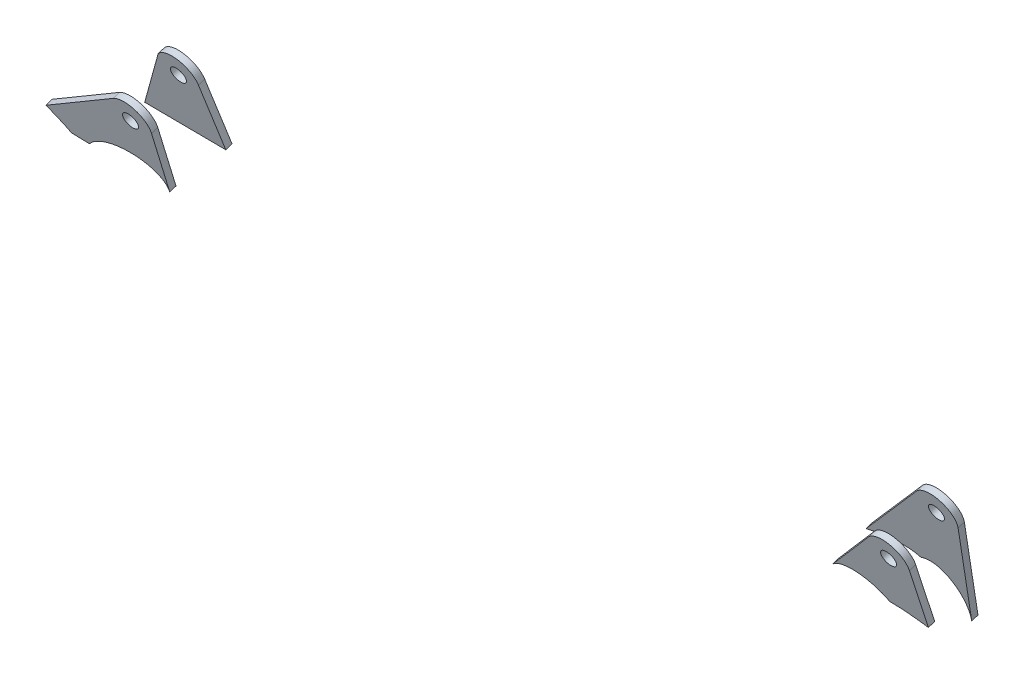
ISO-10303-21;
HEADER;
FILE_DESCRIPTION(('STEP AP214'),'2;1');
FILE_NAME('part.step','',(''),(''),'','','');
FILE_SCHEMA(('AUTOMOTIVE_DESIGN { 1 0 10303 214 1 1 1 1 }'));
ENDSEC;
DATA;
#1=APPLICATION_CONTEXT('core data for automotive mechanical design processes');
#2=APPLICATION_PROTOCOL_DEFINITION('international standard','automotive_design',2000,#1);
#3=PRODUCT_CONTEXT('',#1,'mechanical');
#4=PRODUCT('Part','Part','',(#3));
#5=PRODUCT_RELATED_PRODUCT_CATEGORY('part','',(#4));
#6=PRODUCT_DEFINITION_FORMATION('','',#4);
#7=PRODUCT_DEFINITION_CONTEXT('part definition',#1,'design');
#8=PRODUCT_DEFINITION('design','',#6,#7);
#9=PRODUCT_DEFINITION_SHAPE('','',#8);
#10=(LENGTH_UNIT() NAMED_UNIT(*) SI_UNIT(.MILLI.,.METRE.));
#11=(NAMED_UNIT(*) PLANE_ANGLE_UNIT() SI_UNIT($,.RADIAN.));
#12=(NAMED_UNIT(*) SI_UNIT($,.STERADIAN.) SOLID_ANGLE_UNIT());
#13=UNCERTAINTY_MEASURE_WITH_UNIT(LENGTH_MEASURE(1.E-05),#10,'distance_accuracy_value','');
#14=(GEOMETRIC_REPRESENTATION_CONTEXT(3) GLOBAL_UNCERTAINTY_ASSIGNED_CONTEXT((#13)) GLOBAL_UNIT_ASSIGNED_CONTEXT((#10,
#11,#12)) REPRESENTATION_CONTEXT('',''));
#15=CARTESIAN_POINT('',(0.,0.,0.));
#16=DIRECTION('',(0.,0.,1.));
#17=DIRECTION('',(1.,0.,0.));
#18=AXIS2_PLACEMENT_3D('',#15,#16,#17);
#19=CARTESIAN_POINT('',(1477.60609224479,303.105342312457,275.321832595979));
#20=DIRECTION('',(0.,0.312617860752507,-0.94987897815381));
#21=DIRECTION('',(0.,0.94987897815381,0.312617860752508));
#22=AXIS2_PLACEMENT_3D('',#19,#20,#21);
#23=PLANE('',#22);
#24=CARTESIAN_POINT('',(1490.28835932068,296.982185672542,273.306619949055));
#25=CARTESIAN_POINT('',(1482.92463906708,304.725149140581,275.854932661447));
#26=CARTESIAN_POINT('',(1471.16062190578,306.217295740618,276.346018040491));
#27=CARTESIAN_POINT('',(1464.75604488984,299.191755548486,274.033818911963));
#28=(BOUNDED_CURVE() B_SPLINE_CURVE(3,(#24,#25,#26,#27),.UNSPECIFIED.,.F.,
.F.) B_SPLINE_CURVE_WITH_KNOTS((4,4),(0.,0.854312735758709),
.UNSPECIFIED.) CURVE() GEOMETRIC_REPRESENTATION_ITEM() RATIONAL_B_SPLINE_CURVE((1.,
0.6996343694223,0.655874922431324,0.868721659027074)) REPRESENTATION_ITEM(''));
#29=CARTESIAN_POINT('',(1490.28835932069,296.982185672541,273.306619949054));
#30=VERTEX_POINT('',#29);
#31=CARTESIAN_POINT('',(1464.75604488984,299.191755548487,274.033818911963));
#32=VERTEX_POINT('',#31);
#33=EDGE_CURVE('E170',#30,#32,#28,.T.);
#34=ORIENTED_EDGE('',*,*,#33,.T.);
#35=DIRECTION('',(0.654609201337506,0.718077593990274,0.236328928685024));
#36=VECTOR('',#35,1.);
#37=CARTESIAN_POINT('',(1490.81830917293,327.780916825327,283.442893799002));
#38=LINE('',#37,#36);
#39=CARTESIAN_POINT('',(1490.81830917287,327.780916825374,283.442893799018));
#40=VERTEX_POINT('',#39);
#41=EDGE_CURVE('E99',#32,#40,#38,.T.);
#42=ORIENTED_EDGE('',*,*,#41,.T.);
#43=CARTESIAN_POINT('',(1497.99999999849,321.873821392484,281.498789781598));
#44=DIRECTION('',(0.,0.312617860752503,-0.949878978153811));
#45=DIRECTION('',(0.,0.949878978153811,0.312617860752503));
#46=AXIS2_PLACEMENT_3D('',#43,#44,#45);
#47=CIRCLE('',#46,9.49999999992509);
#48=CARTESIAN_POINT('',(1507.49969493315,321.801504788622,281.474989421219));
#49=VERTEX_POINT('',#48);
#50=EDGE_CURVE('E103',#40,#49,#47,.T.);
#51=ORIENTED_EDGE('',*,*,#50,.T.);
#52=DIRECTION('',(-0.00801394100276196,-0.949848475506329,-0.312607821923743));
#53=VECTOR('',#52,1.);
#54=CARTESIAN_POINT('',(1507.49969493315,321.801504788622,281.474989421219));
#55=LINE('',#54,#53);
#56=CARTESIAN_POINT('',(1507.27194348131,294.807374277776,272.590860466627));
#57=VERTEX_POINT('',#56);
#58=EDGE_CURVE('E107',#49,#57,#55,.T.);
#59=ORIENTED_EDGE('',*,*,#58,.T.);
#60=CARTESIAN_POINT('',(1507.27194348131,294.807374277776,272.590860466627));
#61=CARTESIAN_POINT('',(1501.11282949483,296.214542199823,273.053978227549));
#62=CARTESIAN_POINT('',(1495.33346592051,296.915367578481,273.284629221704));
#63=CARTESIAN_POINT('',(1490.28835932069,296.982185672541,273.306619949054));
#64=(BOUNDED_CURVE() B_SPLINE_CURVE(3,(#60,#61,#62,#63),.UNSPECIFIED.,.F.,
.F.) B_SPLINE_CURVE_WITH_KNOTS((4,4),(0.829977000380445,0.944345935089179),
.UNSPECIFIED.) CURVE() GEOMETRIC_REPRESENTATION_ITEM() RATIONAL_B_SPLINE_CURVE((0.725470626067667,
0.755309292102176,0.806482944640699,0.878991583683235)) REPRESENTATION_ITEM(''));
#65=EDGE_CURVE('E65',#57,#30,#64,.T.);
#66=ORIENTED_EDGE('',*,*,#65,.T.);
#67=EDGE_LOOP('',(#34,#42,#51,#59,#66));
#68=FACE_BOUND('',#67,.T.);
#69=CARTESIAN_POINT('',(1497.99999999849,321.873821392484,281.498789781598));
#70=DIRECTION('',(0.,0.312617860752503,-0.949878978153811));
#71=DIRECTION('',(0.,0.949878978153811,0.312617860752503));
#72=AXIS2_PLACEMENT_3D('',#69,#70,#71);
#73=CIRCLE('',#72,3.49999999999997);
#74=CARTESIAN_POINT('',(1497.99999999849,325.198397816022,282.592952294232));
#75=VERTEX_POINT('',#74);
#76=EDGE_CURVE('E163',#75,#75,#73,.T.);
#77=ORIENTED_EDGE('',*,*,#76,.F.);
#78=EDGE_LOOP('',(#77));
#79=FACE_BOUND('',#78,.T.);
#80=ADVANCED_FACE('F47',(#68,#79),#23,.T.);
#81=CARTESIAN_POINT('',(1477.60609224479,302.167488730199,278.171469530441));
#82=DIRECTION('',(0.,0.312617860752507,-0.94987897815381));
#83=DIRECTION('',(0.,0.94987897815381,0.312617860752508));
#84=AXIS2_PLACEMENT_3D('',#81,#82,#83);
#85=PLANE('',#84);
#86=CARTESIAN_POINT('',(1490.28835932068,296.044332090284,276.156256883516));
#87=CARTESIAN_POINT('',(1482.92463906708,303.787295558324,278.704569595908));
#88=CARTESIAN_POINT('',(1471.16062190578,305.27944215836,279.195654974953));
#89=CARTESIAN_POINT('',(1464.75604488984,298.253901966229,276.883455846425));
#90=(BOUNDED_CURVE() B_SPLINE_CURVE(3,(#86,#87,#88,#89),.UNSPECIFIED.,.F.,
.F.) B_SPLINE_CURVE_WITH_KNOTS((4,4),(0.,0.854312735758709),
.UNSPECIFIED.) CURVE() GEOMETRIC_REPRESENTATION_ITEM() RATIONAL_B_SPLINE_CURVE((1.,
0.6996343694223,0.655874922431324,0.868721659027074)) REPRESENTATION_ITEM(''));
#91=CARTESIAN_POINT('',(1490.28835932069,296.044332090284,276.156256883516));
#92=VERTEX_POINT('',#91);
#93=CARTESIAN_POINT('',(1464.75604488984,298.253901966229,276.883455846425));
#94=VERTEX_POINT('',#93);
#95=EDGE_CURVE('E126',#92,#94,#90,.T.);
#96=ORIENTED_EDGE('',*,*,#95,.F.);
#97=CARTESIAN_POINT('',(1507.27194348131,293.869520695519,275.440497401088));
#98=CARTESIAN_POINT('',(1501.11282949483,295.276688617565,275.903615162011));
#99=CARTESIAN_POINT('',(1495.33346592051,295.977513996224,276.134266156165));
#100=CARTESIAN_POINT('',(1490.28835932069,296.044332090284,276.156256883516));
#101=(BOUNDED_CURVE() B_SPLINE_CURVE(3,(#97,#98,#99,#100),.UNSPECIFIED.,.F.,
.F.) B_SPLINE_CURVE_WITH_KNOTS((4,4),(0.829977000380445,0.944345935089179),
.UNSPECIFIED.) CURVE() GEOMETRIC_REPRESENTATION_ITEM() RATIONAL_B_SPLINE_CURVE((0.725470626067667,
0.755309292102176,0.806482944640699,0.878991583683235)) REPRESENTATION_ITEM(''));
#102=CARTESIAN_POINT('',(1507.27194348131,293.869520695519,275.440497401088));
#103=VERTEX_POINT('',#102);
#104=EDGE_CURVE('E91',#103,#92,#101,.T.);
#105=ORIENTED_EDGE('',*,*,#104,.F.);
#106=DIRECTION('',(-0.00801394100276196,-0.949848475506329,-0.312607821923743));
#107=VECTOR('',#106,1.);
#108=CARTESIAN_POINT('',(1507.49969493315,320.863651206365,284.32462635568));
#109=LINE('',#108,#107);
#110=CARTESIAN_POINT('',(1507.49969493315,320.863651206365,284.32462635568));
#111=VERTEX_POINT('',#110);
#112=EDGE_CURVE('E85',#111,#103,#109,.T.);
#113=ORIENTED_EDGE('',*,*,#112,.F.);
#114=CARTESIAN_POINT('',(1497.99999999849,320.935967810226,284.348426716059));
#115=DIRECTION('',(0.,0.312617860752503,-0.949878978153811));
#116=DIRECTION('',(0.,0.949878978153811,0.312617860752503));
#117=AXIS2_PLACEMENT_3D('',#114,#115,#116);
#118=CIRCLE('',#117,9.49999999992509);
#119=CARTESIAN_POINT('',(1490.81830917287,326.843063243117,286.292530733479));
#120=VERTEX_POINT('',#119);
#121=EDGE_CURVE('E114',#120,#111,#118,.T.);
#122=ORIENTED_EDGE('',*,*,#121,.F.);
#123=DIRECTION('',(0.654609201337506,0.718077593990274,0.236328928685024));
#124=VECTOR('',#123,1.);
#125=CARTESIAN_POINT('',(1490.81830917293,326.84306324307,286.292530733463));
#126=LINE('',#125,#124);
#127=EDGE_CURVE('E190',#94,#120,#126,.T.);
#128=ORIENTED_EDGE('',*,*,#127,.F.);
#129=EDGE_LOOP('',(#96,#105,#113,#122,#128));
#130=FACE_BOUND('',#129,.T.);
#131=CARTESIAN_POINT('',(1497.99999999849,320.935967810226,284.348426716059));
#132=DIRECTION('',(0.,0.312617860752503,-0.949878978153811));
#133=DIRECTION('',(0.,0.949878978153811,0.312617860752503));
#134=AXIS2_PLACEMENT_3D('',#131,#132,#133);
#135=CIRCLE('',#134,3.49999999999997);
#136=CARTESIAN_POINT('',(1497.99999999849,324.260544233765,285.442589228693));
#137=VERTEX_POINT('',#136);
#138=EDGE_CURVE('E166',#137,#137,#135,.T.);
#139=ORIENTED_EDGE('',*,*,#138,.T.);
#140=EDGE_LOOP('',(#139));
#141=FACE_BOUND('',#140,.T.);
#142=ADVANCED_FACE('F139',(#130,#141),#85,.F.);
#143=DIRECTION('',(0.,-0.312617860752503,0.949878978153811));
#144=VECTOR('',#143,1.);
#145=SURFACE_OF_LINEAR_EXTRUSION('',#28,#144);
#146=ORIENTED_EDGE('',*,*,#95,.T.);
#147=DIRECTION('',(0.,-0.312617860752503,0.949878978153811));
#148=VECTOR('',#147,1.);
#149=CARTESIAN_POINT('',(1464.75604488984,299.191755548487,274.033818911963));
#150=LINE('',#149,#148);
#151=EDGE_CURVE('E12',#32,#94,#150,.T.);
#152=ORIENTED_EDGE('',*,*,#151,.F.);
#153=ORIENTED_EDGE('',*,*,#33,.F.);
#154=DIRECTION('',(0.,-0.312617860752503,0.949878978153811));
#155=VECTOR('',#154,1.);
#156=CARTESIAN_POINT('',(1490.28835932069,296.982185672541,273.306619949054));
#157=LINE('',#156,#155);
#158=EDGE_CURVE('E119',#30,#92,#157,.T.);
#159=ORIENTED_EDGE('',*,*,#158,.T.);
#160=EDGE_LOOP('',(#146,#152,#153,#159));
#161=FACE_BOUND('',#160,.T.);
#162=ADVANCED_FACE('F49',(#161),#145,.F.);
#163=CARTESIAN_POINT('',(1490.81830917293,327.780916825327,283.442893799002));
#164=DIRECTION('',(0.755967455334072,-0.621799519256543,-0.204642528151066));
#165=DIRECTION('',(0.635243315306602,0.772312067986949,0.));
#166=AXIS2_PLACEMENT_3D('',#163,#164,#165);
#167=PLANE('',#166);
#168=ORIENTED_EDGE('',*,*,#127,.T.);
#169=DIRECTION('',(0.,-0.312617860752503,0.949878978153811));
#170=VECTOR('',#169,1.);
#171=CARTESIAN_POINT('',(1490.81830917287,327.780916825374,283.442893799018));
#172=LINE('',#171,#170);
#173=EDGE_CURVE('E57',#40,#120,#172,.T.);
#174=ORIENTED_EDGE('',*,*,#173,.F.);
#175=ORIENTED_EDGE('',*,*,#41,.F.);
#176=ORIENTED_EDGE('',*,*,#151,.T.);
#177=EDGE_LOOP('',(#168,#174,#175,#176));
#178=FACE_BOUND('',#177,.T.);
#179=ADVANCED_FACE('F144',(#178),#167,.F.);
#180=CARTESIAN_POINT('',(1497.99999999849,321.873821392484,281.498789781598));
#181=DIRECTION('',(0.,-0.312617860752503,0.949878978153811));
#182=DIRECTION('',(0.,-0.949878978153811,-0.312617860752503));
#183=AXIS2_PLACEMENT_3D('',#180,#181,#182);
#184=CYLINDRICAL_SURFACE('',#183,9.49999999992509);
#185=ORIENTED_EDGE('',*,*,#121,.T.);
#186=DIRECTION('',(0.,-0.312617860752503,0.949878978153811));
#187=VECTOR('',#186,1.);
#188=CARTESIAN_POINT('',(1507.49969493315,321.801504788622,281.474989421219));
#189=LINE('',#188,#187);
#190=EDGE_CURVE('E111',#49,#111,#189,.T.);
#191=ORIENTED_EDGE('',*,*,#190,.F.);
#192=ORIENTED_EDGE('',*,*,#50,.F.);
#193=ORIENTED_EDGE('',*,*,#173,.T.);
#194=EDGE_LOOP('',(#185,#191,#192,#193));
#195=FACE_BOUND('',#194,.T.);
#196=ADVANCED_FACE('F112',(#195),#184,.T.);
#197=CARTESIAN_POINT('',(1507.49969493315,321.801504788622,281.474989421219));
#198=DIRECTION('',(-0.999967887859207,0.00761227409067549,0.00250530109251963));
#199=DIRECTION('',(-0.00761229798013486,-0.999971026039986,0.));
#200=AXIS2_PLACEMENT_3D('',#197,#198,#199);
#201=PLANE('',#200);
#202=ORIENTED_EDGE('',*,*,#112,.T.);
#203=DIRECTION('',(0.,-0.312617860752503,0.949878978153811));
#204=VECTOR('',#203,1.);
#205=CARTESIAN_POINT('',(1507.27194348131,294.807374277776,272.590860466627));
#206=LINE('',#205,#204);
#207=EDGE_CURVE('E115',#57,#103,#206,.T.);
#208=ORIENTED_EDGE('',*,*,#207,.F.);
#209=ORIENTED_EDGE('',*,*,#58,.F.);
#210=ORIENTED_EDGE('',*,*,#190,.T.);
#211=EDGE_LOOP('',(#202,#208,#209,#210));
#212=FACE_BOUND('',#211,.T.);
#213=ADVANCED_FACE('F117',(#212),#201,.F.);
#214=DIRECTION('',(0.,-0.312617860752503,0.949878978153811));
#215=VECTOR('',#214,1.);
#216=SURFACE_OF_LINEAR_EXTRUSION('',#64,#215);
#217=ORIENTED_EDGE('',*,*,#104,.T.);
#218=ORIENTED_EDGE('',*,*,#158,.F.);
#219=ORIENTED_EDGE('',*,*,#65,.F.);
#220=ORIENTED_EDGE('',*,*,#207,.T.);
#221=EDGE_LOOP('',(#217,#218,#219,#220));
#222=FACE_BOUND('',#221,.T.);
#223=ADVANCED_FACE('F134',(#222),#216,.F.);
#224=CARTESIAN_POINT('',(1497.99999999849,321.873821392484,281.498789781598));
#225=DIRECTION('',(0.,-0.312617860752503,0.949878978153811));
#226=DIRECTION('',(0.,-0.949878978153811,-0.312617860752503));
#227=AXIS2_PLACEMENT_3D('',#224,#225,#226);
#228=CYLINDRICAL_SURFACE('',#227,3.49999999999997);
#229=ORIENTED_EDGE('',*,*,#76,.T.);
#230=EDGE_LOOP('',(#229));
#231=FACE_BOUND('',#230,.T.);
#232=ORIENTED_EDGE('',*,*,#138,.F.);
#233=EDGE_LOOP('',(#232));
#234=FACE_BOUND('',#233,.T.);
#235=ADVANCED_FACE('F138',(#231,#234),#228,.F.);
#236=CLOSED_SHELL('',(#80,#142,#162,#179,#196,#213,#223,#235));
#237=MANIFOLD_SOLID_BREP('B2',#236);
#238=CARTESIAN_POINT('',(1150.60638602175,302.676593906539,275.180725768133));
#239=DIRECTION('',(0.,0.312617860752493,-0.949878978153815));
#240=DIRECTION('',(0.,0.949878978153815,0.312617860752493));
#241=AXIS2_PLACEMENT_3D('',#238,#239,#240);
#242=PLANE('',#241);
#243=CARTESIAN_POINT('',(1160.51126961946,293.309604113994,272.097924297646));
#244=CARTESIAN_POINT('',(1160.53819860003,294.0835163006,272.352629136633));
#245=CARTESIAN_POINT('',(1160.44654946192,294.817821993672,272.59429894951));
#246=CARTESIAN_POINT('',(1160.25609923996,295.508064908945,272.821467113597));
#247=CARTESIAN_POINT('',(1157.22561994141,306.491338355881,276.436209126011));
#248=CARTESIAN_POINT('',(1137.02965580079,309.686782647571,277.487872529031));
#249=CARTESIAN_POINT('',(1124.30827637307,294.446208321948,272.471995925913));
#250=(BOUNDED_CURVE() B_SPLINE_CURVE(3,(#243,#244,#245,#246,#247,#248,#249),.UNSPECIFIED.,.F.,
.F.) B_SPLINE_CURVE_WITH_KNOTS((4,3,4),(0.957482722600108,1.,1.36661687005978),
.UNSPECIFIED.) CURVE() GEOMETRIC_REPRESENTATION_ITEM() RATIONAL_B_SPLINE_CURVE((0.844392641420427,
0.89144117727362,0.943310296800144,1.,0.511177506586965,0.380776158273735,0.60879595506031)) REPRESENTATION_ITEM(''));
#251=CARTESIAN_POINT('',(1160.51126961946,293.309604113994,272.097924297646));
#252=VERTEX_POINT('',#251);
#253=CARTESIAN_POINT('',(1124.30827637307,294.446208321948,272.471995925913));
#254=VERTEX_POINT('',#253);
#255=EDGE_CURVE('E356',#252,#254,#250,.T.);
#256=ORIENTED_EDGE('',*,*,#255,.T.);
#257=DIRECTION('',(-0.999454232885543,0.0313781758044829,0.0103269768254261));
#258=VECTOR('',#257,1.);
#259=CARTESIAN_POINT('',(1124.30827637307,294.446208321948,272.471995925913));
#260=LINE('',#259,#258);
#261=CARTESIAN_POINT('',(1116.21528424048,294.700290321468,272.555617706133));
#262=VERTEX_POINT('',#261);
#263=EDGE_CURVE('E304',#254,#262,#260,.T.);
#264=ORIENTED_EDGE('',*,*,#263,.T.);
#265=CARTESIAN_POINT('',(1116.21528424048,294.70029032147,272.555617706133));
#266=CARTESIAN_POINT('',(1114.29416978169,296.728324898537,273.223070977125));
#267=CARTESIAN_POINT('',(1111.26189624906,299.260791615964,274.05653960401));
#268=CARTESIAN_POINT('',(1106.98846045663,302.322860747585,275.064307460147));
#269=(BOUNDED_CURVE() B_SPLINE_CURVE(3,(#265,#266,#267,#268),.UNSPECIFIED.,.F.,
.F.) B_SPLINE_CURVE_WITH_KNOTS((4,4),(0.553642055003312,0.604482392039259),
.UNSPECIFIED.) CURVE() GEOMETRIC_REPRESENTATION_ITEM() RATIONAL_B_SPLINE_CURVE((0.815243898156747,
0.763889723459809,0.719183773640757,0.681126048699591)) REPRESENTATION_ITEM(''));
#270=CARTESIAN_POINT('',(1106.98846045663,302.322860747585,275.064307460147));
#271=VERTEX_POINT('',#270);
#272=EDGE_CURVE('E317',#262,#271,#269,.T.);
#273=ORIENTED_EDGE('',*,*,#272,.T.);
#274=DIRECTION('',(0.812699591487332,0.553478247456593,0.1821570849259));
#275=VECTOR('',#274,1.);
#276=CARTESIAN_POINT('',(1146.46451235169,329.207500838766,283.912401654988));
#277=LINE('',#276,#275);
#278=CARTESIAN_POINT('',(1146.46451235169,329.207500838766,283.912401654988));
#279=VERTEX_POINT('',#278);
#280=EDGE_CURVE('E311',#271,#279,#277,.T.);
#281=ORIENTED_EDGE('',*,*,#280,.T.);
#282=CARTESIAN_POINT('',(1151.99999999987,321.87382139244,281.498789781599));
#283=DIRECTION('',(0.,0.312617860752503,-0.949878978153811));
#284=DIRECTION('',(0.,0.949878978153811,0.312617860752503));
#285=AXIS2_PLACEMENT_3D('',#282,#283,#284);
#286=CIRCLE('',#285,9.50000000002886);
#287=CARTESIAN_POINT('',(1161.49481521232,321.575728722278,281.40068350175));
#288=VERTEX_POINT('',#287);
#289=EDGE_CURVE('E315',#279,#288,#286,.T.);
#290=ORIENTED_EDGE('',*,*,#289,.T.);
#291=DIRECTION('',(-0.0330338669748213,-0.949360565444755,-0.312447244204691));
#292=VECTOR('',#291,1.);
#293=CARTESIAN_POINT('',(1161.49481521234,321.575728722277,281.40068350175));
#294=LINE('',#293,#292);
#295=EDGE_CURVE('E267',#288,#252,#294,.T.);
#296=ORIENTED_EDGE('',*,*,#295,.T.);
#297=EDGE_LOOP('',(#256,#264,#273,#281,#290,#296));
#298=FACE_BOUND('',#297,.T.);
#299=CARTESIAN_POINT('',(1151.99999999987,321.87382139244,281.498789781599));
#300=DIRECTION('',(0.,0.312617860752503,-0.949878978153811));
#301=DIRECTION('',(0.,0.949878978153811,0.312617860752503));
#302=AXIS2_PLACEMENT_3D('',#299,#300,#301);
#303=CIRCLE('',#302,3.49999999999997);
#304=CARTESIAN_POINT('',(1151.99999999987,325.198397815979,282.592952294232));
#305=VERTEX_POINT('',#304);
#306=EDGE_CURVE('E341',#305,#305,#303,.T.);
#307=ORIENTED_EDGE('',*,*,#306,.F.);
#308=EDGE_LOOP('',(#307));
#309=FACE_BOUND('',#308,.T.);
#310=ADVANCED_FACE('F249',(#298,#309),#242,.T.);
#311=CARTESIAN_POINT('',(1150.60638602175,301.738740324282,278.030362702594));
#312=DIRECTION('',(0.,0.312617860752493,-0.949878978153815));
#313=DIRECTION('',(0.,0.949878978153815,0.312617860752493));
#314=AXIS2_PLACEMENT_3D('',#311,#312,#313);
#315=PLANE('',#314);
#316=CARTESIAN_POINT('',(1160.51126961946,292.371750531736,274.947561232108));
#317=CARTESIAN_POINT('',(1160.53819860003,293.145662718343,275.202266071094));
#318=CARTESIAN_POINT('',(1160.44654946192,293.879968411414,275.443935883971));
#319=CARTESIAN_POINT('',(1160.25609923997,294.570211326687,275.671104048059));
#320=CARTESIAN_POINT('',(1157.22561994141,305.553484773623,279.285846060472));
#321=CARTESIAN_POINT('',(1137.02965580079,308.748929065313,280.337509463492));
#322=CARTESIAN_POINT('',(1124.30827637307,293.508354739691,275.321632860375));
#323=(BOUNDED_CURVE() B_SPLINE_CURVE(3,(#316,#317,#318,#319,#320,#321,#322),.UNSPECIFIED.,.F.,
.F.) B_SPLINE_CURVE_WITH_KNOTS((4,3,4),(0.957482722600108,1.,1.36661687005978),
.UNSPECIFIED.) CURVE() GEOMETRIC_REPRESENTATION_ITEM() RATIONAL_B_SPLINE_CURVE((0.844392641420427,
0.89144117727362,0.943310296800144,1.,0.511177506586965,0.380776158273735,0.60879595506031)) REPRESENTATION_ITEM(''));
#324=CARTESIAN_POINT('',(1160.51126961946,292.371750531737,274.947561232108));
#325=VERTEX_POINT('',#324);
#326=CARTESIAN_POINT('',(1124.30827637307,293.508354739691,275.321632860375));
#327=VERTEX_POINT('',#326);
#328=EDGE_CURVE('E335',#325,#327,#323,.T.);
#329=ORIENTED_EDGE('',*,*,#328,.F.);
#330=DIRECTION('',(-0.0330338669748213,-0.949360565444755,-0.312447244204691));
#331=VECTOR('',#330,1.);
#332=CARTESIAN_POINT('',(1161.49481521234,320.637875140019,284.250320436212));
#333=LINE('',#332,#331);
#334=CARTESIAN_POINT('',(1161.49481521232,320.63787514002,284.250320436212));
#335=VERTEX_POINT('',#334);
#336=EDGE_CURVE('E296',#335,#325,#333,.T.);
#337=ORIENTED_EDGE('',*,*,#336,.F.);
#338=CARTESIAN_POINT('',(1151.99999999987,320.935967810183,284.34842671606));
#339=DIRECTION('',(0.,0.312617860752503,-0.949878978153811));
#340=DIRECTION('',(0.,0.949878978153811,0.312617860752503));
#341=AXIS2_PLACEMENT_3D('',#338,#339,#340);
#342=CIRCLE('',#341,9.50000000002886);
#343=CARTESIAN_POINT('',(1146.46451235169,328.269647256509,286.76203858945));
#344=VERTEX_POINT('',#343);
#345=EDGE_CURVE('E290',#344,#335,#342,.T.);
#346=ORIENTED_EDGE('',*,*,#345,.F.);
#347=DIRECTION('',(0.812699591487332,0.553478247456593,0.1821570849259));
#348=VECTOR('',#347,1.);
#349=CARTESIAN_POINT('',(1146.46451235169,328.269647256509,286.76203858945));
#350=LINE('',#349,#348);
#351=CARTESIAN_POINT('',(1106.98846045663,301.385007165328,277.913944394609));
#352=VERTEX_POINT('',#351);
#353=EDGE_CURVE('E325',#352,#344,#350,.T.);
#354=ORIENTED_EDGE('',*,*,#353,.F.);
#355=CARTESIAN_POINT('',(1116.21528424048,293.762436739212,275.405254640594));
#356=CARTESIAN_POINT('',(1114.29416978169,295.79047131628,276.072707911586));
#357=CARTESIAN_POINT('',(1111.26189624906,298.322938033706,276.906176538471));
#358=CARTESIAN_POINT('',(1106.98846045663,301.385007165328,277.913944394609));
#359=(BOUNDED_CURVE() B_SPLINE_CURVE(3,(#355,#356,#357,#358),.UNSPECIFIED.,.F.,
.F.) B_SPLINE_CURVE_WITH_KNOTS((4,4),(0.553642055003312,0.604482392039259),
.UNSPECIFIED.) CURVE() GEOMETRIC_REPRESENTATION_ITEM() RATIONAL_B_SPLINE_CURVE((0.815243898156747,
0.763889723459809,0.719183773640757,0.681126048699591)) REPRESENTATION_ITEM(''));
#360=CARTESIAN_POINT('',(1116.21528424048,293.762436739211,275.405254640594));
#361=VERTEX_POINT('',#360);
#362=EDGE_CURVE('E346',#361,#352,#359,.T.);
#363=ORIENTED_EDGE('',*,*,#362,.F.);
#364=DIRECTION('',(-0.999454232885543,0.0313781758044829,0.0103269768254261));
#365=VECTOR('',#364,1.);
#366=CARTESIAN_POINT('',(1124.30827637307,293.508354739691,275.321632860375));
#367=LINE('',#366,#365);
#368=EDGE_CURVE('E340',#327,#361,#367,.T.);
#369=ORIENTED_EDGE('',*,*,#368,.F.);
#370=EDGE_LOOP('',(#329,#337,#346,#354,#363,#369));
#371=FACE_BOUND('',#370,.T.);
#372=CARTESIAN_POINT('',(1151.99999999987,320.935967810183,284.34842671606));
#373=DIRECTION('',(0.,0.312617860752503,-0.949878978153811));
#374=DIRECTION('',(0.,0.949878978153811,0.312617860752503));
#375=AXIS2_PLACEMENT_3D('',#372,#373,#374);
#376=CIRCLE('',#375,3.49999999999997);
#377=CARTESIAN_POINT('',(1151.99999999987,324.260544233721,285.442589228694));
#378=VERTEX_POINT('',#377);
#379=EDGE_CURVE('E410',#378,#378,#376,.T.);
#380=ORIENTED_EDGE('',*,*,#379,.T.);
#381=EDGE_LOOP('',(#380));
#382=FACE_BOUND('',#381,.T.);
#383=ADVANCED_FACE('F365',(#371,#382),#315,.F.);
#384=DIRECTION('',(0.,-0.312617860752503,0.949878978153811));
#385=VECTOR('',#384,1.);
#386=SURFACE_OF_LINEAR_EXTRUSION('',#250,#385);
#387=ORIENTED_EDGE('',*,*,#328,.T.);
#388=DIRECTION('',(0.,-0.312617860752503,0.949878978153811));
#389=VECTOR('',#388,1.);
#390=CARTESIAN_POINT('',(1124.30827637307,294.446208321948,272.471995925913));
#391=LINE('',#390,#389);
#392=EDGE_CURVE('E45',#254,#327,#391,.T.);
#393=ORIENTED_EDGE('',*,*,#392,.F.);
#394=ORIENTED_EDGE('',*,*,#255,.F.);
#395=DIRECTION('',(0.,-0.312617860752503,0.949878978153811));
#396=VECTOR('',#395,1.);
#397=CARTESIAN_POINT('',(1160.51126961946,293.309604113994,272.097924297646));
#398=LINE('',#397,#396);
#399=EDGE_CURVE('E331',#252,#325,#398,.T.);
#400=ORIENTED_EDGE('',*,*,#399,.T.);
#401=EDGE_LOOP('',(#387,#393,#394,#400));
#402=FACE_BOUND('',#401,.T.);
#403=ADVANCED_FACE('F251',(#402),#386,.F.);
#404=CARTESIAN_POINT('',(1124.30827637307,294.446208321948,272.471995925913));
#405=DIRECTION('',(0.0330338669726982,0.949360565444822,0.312447244204711));
#406=DIRECTION('',(0.,-0.312617860752502,0.949878978153812));
#407=AXIS2_PLACEMENT_3D('',#404,#405,#406);
#408=PLANE('',#407);
#409=ORIENTED_EDGE('',*,*,#368,.T.);
#410=DIRECTION('',(0.,-0.312617860752503,0.949878978153811));
#411=VECTOR('',#410,1.);
#412=CARTESIAN_POINT('',(1116.21528424048,294.700290321468,272.555617706133));
#413=LINE('',#412,#411);
#414=EDGE_CURVE('E259',#262,#361,#413,.T.);
#415=ORIENTED_EDGE('',*,*,#414,.F.);
#416=ORIENTED_EDGE('',*,*,#263,.F.);
#417=ORIENTED_EDGE('',*,*,#392,.T.);
#418=EDGE_LOOP('',(#409,#415,#416,#417));
#419=FACE_BOUND('',#418,.T.);
#420=ADVANCED_FACE('F390',(#419),#408,.F.);
#421=DIRECTION('',(0.,-0.312617860752503,0.949878978153811));
#422=VECTOR('',#421,1.);
#423=SURFACE_OF_LINEAR_EXTRUSION('',#269,#422);
#424=ORIENTED_EDGE('',*,*,#362,.T.);
#425=DIRECTION('',(0.,-0.312617860752503,0.949878978153811));
#426=VECTOR('',#425,1.);
#427=CARTESIAN_POINT('',(1106.98846045663,302.322860747585,275.064307460147));
#428=LINE('',#427,#426);
#429=EDGE_CURVE('E326',#271,#352,#428,.T.);
#430=ORIENTED_EDGE('',*,*,#429,.F.);
#431=ORIENTED_EDGE('',*,*,#272,.F.);
#432=ORIENTED_EDGE('',*,*,#414,.T.);
#433=EDGE_LOOP('',(#424,#430,#431,#432));
#434=FACE_BOUND('',#433,.T.);
#435=ADVANCED_FACE('F362',(#434),#423,.F.);
#436=CARTESIAN_POINT('',(1146.46451235169,329.207500838766,283.912401654988));
#437=DIRECTION('',(0.582682910334878,-0.771966257507999,-0.254064407725226));
#438=DIRECTION('',(0.798155906395944,0.602450951601265,0.));
#439=AXIS2_PLACEMENT_3D('',#436,#437,#438);
#440=PLANE('',#439);
#441=ORIENTED_EDGE('',*,*,#353,.T.);
#442=DIRECTION('',(0.,-0.312617860752503,0.949878978153811));
#443=VECTOR('',#442,1.);
#444=CARTESIAN_POINT('',(1146.46451235169,329.207500838766,283.912401654988));
#445=LINE('',#444,#443);
#446=EDGE_CURVE('E322',#279,#344,#445,.T.);
#447=ORIENTED_EDGE('',*,*,#446,.F.);
#448=ORIENTED_EDGE('',*,*,#280,.F.);
#449=ORIENTED_EDGE('',*,*,#429,.T.);
#450=EDGE_LOOP('',(#441,#447,#448,#449));
#451=FACE_BOUND('',#450,.T.);
#452=ADVANCED_FACE('F323',(#451),#440,.F.);
#453=CARTESIAN_POINT('',(1151.99999999987,321.87382139244,281.498789781599));
#454=DIRECTION('',(0.,-0.312617860752503,0.949878978153811));
#455=DIRECTION('',(0.,-0.949878978153811,-0.312617860752503));
#456=AXIS2_PLACEMENT_3D('',#453,#454,#455);
#457=CYLINDRICAL_SURFACE('',#456,9.50000000002886);
#458=ORIENTED_EDGE('',*,*,#345,.T.);
#459=DIRECTION('',(0.,-0.312617860752503,0.949878978153811));
#460=VECTOR('',#459,1.);
#461=CARTESIAN_POINT('',(1161.49481521232,321.575728722278,281.40068350175));
#462=LINE('',#461,#460);
#463=EDGE_CURVE('E327',#288,#335,#462,.T.);
#464=ORIENTED_EDGE('',*,*,#463,.F.);
#465=ORIENTED_EDGE('',*,*,#289,.F.);
#466=ORIENTED_EDGE('',*,*,#446,.T.);
#467=EDGE_LOOP('',(#458,#464,#465,#466));
#468=FACE_BOUND('',#467,.T.);
#469=ADVANCED_FACE('F329',(#468),#457,.T.);
#470=CARTESIAN_POINT('',(1161.49481521234,321.575728722277,281.40068350175));
#471=DIRECTION('',(-0.999454232885473,0.0313781758064993,0.0103269768260908));
#472=DIRECTION('',(-0.031379849125875,-0.999507531271694,0.));
#473=AXIS2_PLACEMENT_3D('',#470,#471,#472);
#474=PLANE('',#473);
#475=ORIENTED_EDGE('',*,*,#336,.T.);
#476=ORIENTED_EDGE('',*,*,#399,.F.);
#477=ORIENTED_EDGE('',*,*,#295,.F.);
#478=ORIENTED_EDGE('',*,*,#463,.T.);
#479=EDGE_LOOP('',(#475,#476,#477,#478));
#480=FACE_BOUND('',#479,.T.);
#481=ADVANCED_FACE('F370',(#480),#474,.F.);
#482=CARTESIAN_POINT('',(1151.99999999987,321.87382139244,281.498789781599));
#483=DIRECTION('',(0.,-0.312617860752503,0.949878978153811));
#484=DIRECTION('',(0.,-0.949878978153811,-0.312617860752503));
#485=AXIS2_PLACEMENT_3D('',#482,#483,#484);
#486=CYLINDRICAL_SURFACE('',#485,3.49999999999997);
#487=ORIENTED_EDGE('',*,*,#306,.T.);
#488=EDGE_LOOP('',(#487));
#489=FACE_BOUND('',#488,.T.);
#490=ORIENTED_EDGE('',*,*,#379,.F.);
#491=EDGE_LOOP('',(#490));
#492=FACE_BOUND('',#491,.T.);
#493=ADVANCED_FACE('F372',(#489,#492),#486,.F.);
#494=CLOSED_SHELL('',(#310,#383,#403,#420,#435,#452,#469,#481,#493));
#495=MANIFOLD_SOLID_BREP('B6',#494);
#496=CARTESIAN_POINT('',(1188.83472119183,66.5653155900017,173.259739038832));
#497=DIRECTION('',(-0.995159947040671,-0.0933430939858205,-0.0307204591626415));
#498=DIRECTION('',(0.0933871713009502,-0.995629869096145,0.));
#499=AXIS2_PLACEMENT_3D('',#496,#497,#498);
#500=PLANE('',#499);
#501=DIRECTION('',(0.098268406957726,-0.945281513594592,-0.311104773750433));
#502=VECTOR('',#501,1.);
#503=CARTESIAN_POINT('',(1188.83472119183,65.6274620077442,176.109375973293));
#504=LINE('',#503,#502);
#505=CARTESIAN_POINT('',(1161.45401949675,329.012938000438,262.793054580595));
#506=VERTEX_POINT('',#505);
#507=CARTESIAN_POINT('',(1164.45040115727,300.189593051163,253.306906718593));
#508=VERTEX_POINT('',#507);
#509=EDGE_CURVE('E546',#506,#508,#504,.T.);
#510=ORIENTED_EDGE('',*,*,#509,.T.);
#511=DIRECTION('',(0.,-0.312617860752503,0.949878978153811));
#512=VECTOR('',#511,1.);
#513=CARTESIAN_POINT('',(1164.45040115727,301.127446633421,250.457269784132));
#514=LINE('',#513,#512);
#515=CARTESIAN_POINT('',(1164.45040115727,301.127446633421,250.457269784132));
#516=VERTEX_POINT('',#515);
#517=EDGE_CURVE('E247',#516,#508,#514,.T.);
#518=ORIENTED_EDGE('',*,*,#517,.F.);
#519=DIRECTION('',(0.098268406957726,-0.945281513594592,-0.311104773750433));
#520=VECTOR('',#519,1.);
#521=CARTESIAN_POINT('',(1188.83472119183,66.5653155900017,173.259739038832));
#522=LINE('',#521,#520);
#523=CARTESIAN_POINT('',(1161.45401949675,329.950791582696,259.943417646133));
#524=VERTEX_POINT('',#523);
#525=EDGE_CURVE('E528',#524,#516,#522,.T.);
#526=ORIENTED_EDGE('',*,*,#525,.F.);
#527=DIRECTION('',(0.,-0.312617860752503,0.949878978153811));
#528=VECTOR('',#527,1.);
#529=CARTESIAN_POINT('',(1161.45401949675,329.950791582696,259.943417646133));
#530=LINE('',#529,#528);
#531=EDGE_CURVE('E536',#524,#506,#530,.T.);
#532=ORIENTED_EDGE('',*,*,#531,.T.);
#533=EDGE_LOOP('',(#510,#518,#526,#532));
#534=FACE_BOUND('',#533,.T.);
#535=ADVANCED_FACE('F476',(#534),#500,.F.);
#536=CARTESIAN_POINT('',(1164.45040115726,301.127446633492,250.457269784155));
#537=CARTESIAN_POINT('',(1152.61105185229,301.279932760058,250.507455005408));
#538=CARTESIAN_POINT('',(1140.31279813949,301.425017593943,250.555204362369));
#539=CARTESIAN_POINT('',(1127.57899479799,301.562701205134,250.600517878071));
#540=(BOUNDED_CURVE() B_SPLINE_CURVE(3,(#536,#537,#538,#539),.UNSPECIFIED.,.F.,
.F.) B_SPLINE_CURVE_WITH_KNOTS((4,4),(0.951482823133035,1.),
.UNSPECIFIED.) CURVE() GEOMETRIC_REPRESENTATION_ITEM() RATIONAL_B_SPLINE_CURVE((0.978494800629812,
0.985297675670492,0.992466075460555,1.)) REPRESENTATION_ITEM(''));
#541=DIRECTION('',(0.,-0.312617860752503,0.949878978153811));
#542=VECTOR('',#541,1.);
#543=SURFACE_OF_LINEAR_EXTRUSION('',#540,#542);
#544=CARTESIAN_POINT('',(1164.45040115726,300.189593051235,253.306906718617));
#545=CARTESIAN_POINT('',(1152.61105185229,300.3420791778,253.357091939869));
#546=CARTESIAN_POINT('',(1140.31279813949,300.487164011686,253.40484129683));
#547=CARTESIAN_POINT('',(1127.57899479799,300.624847622877,253.450154812533));
#548=(BOUNDED_CURVE() B_SPLINE_CURVE(3,(#544,#545,#546,#547),.UNSPECIFIED.,.F.,
.F.) B_SPLINE_CURVE_WITH_KNOTS((4,4),(0.951482823133035,1.),
.UNSPECIFIED.) CURVE() GEOMETRIC_REPRESENTATION_ITEM() RATIONAL_B_SPLINE_CURVE((0.978494800629812,
0.985297675670492,0.992466075460555,1.)) REPRESENTATION_ITEM(''));
#549=CARTESIAN_POINT('',(1127.57899479798,300.62484762286,253.450154812527));
#550=VERTEX_POINT('',#549);
#551=EDGE_CURVE('E532',#508,#550,#548,.T.);
#552=ORIENTED_EDGE('',*,*,#551,.T.);
#553=DIRECTION('',(0.,-0.312617860752503,0.949878978153811));
#554=VECTOR('',#553,1.);
#555=CARTESIAN_POINT('',(1127.57899479798,301.562701205118,250.600517878066));
#556=LINE('',#555,#554);
#557=CARTESIAN_POINT('',(1127.57899479798,301.562701205118,250.600517878066));
#558=VERTEX_POINT('',#557);
#559=EDGE_CURVE('E485',#558,#550,#556,.T.);
#560=ORIENTED_EDGE('',*,*,#559,.F.);
#561=EDGE_CURVE('E523',#516,#558,#540,.T.);
#562=ORIENTED_EDGE('',*,*,#561,.F.);
#563=ORIENTED_EDGE('',*,*,#517,.T.);
#564=EDGE_LOOP('',(#552,#560,#562,#563));
#565=FACE_BOUND('',#564,.T.);
#566=ADVANCED_FACE('F531',(#565),#543,.F.);
#567=CARTESIAN_POINT('',(766.744712390222,-400.506036760729,19.5403175663812));
#568=DIRECTION('',(0.898629022567056,-0.416720773952975,-0.137148373509166));
#569=DIRECTION('',(0.420696135589546,0.907201610172745,0.));
#570=AXIS2_PLACEMENT_3D('',#567,#568,#569);
#571=PLANE('',#570);
#572=DIRECTION('',(0.438709334070038,0.85358881769536,0.280927482645009));
#573=VECTOR('',#572,1.);
#574=CARTESIAN_POINT('',(766.744712390222,-401.443890342986,22.3899545008426));
#575=LINE('',#574,#573);
#576=CARTESIAN_POINT('',(1144.65487926327,333.84908722726,264.384695895268));
#577=VERTEX_POINT('',#576);
#578=EDGE_CURVE('E510',#550,#577,#575,.T.);
#579=ORIENTED_EDGE('',*,*,#578,.T.);
#580=DIRECTION('',(0.,-0.312617860752503,0.949878978153811));
#581=VECTOR('',#580,1.);
#582=CARTESIAN_POINT('',(1144.65487926327,334.786940809518,261.535058960807));
#583=LINE('',#582,#581);
#584=CARTESIAN_POINT('',(1144.65487926327,334.786940809518,261.535058960807));
#585=VERTEX_POINT('',#584);
#586=EDGE_CURVE('E533',#585,#577,#583,.T.);
#587=ORIENTED_EDGE('',*,*,#586,.F.);
#588=DIRECTION('',(0.438709334070038,0.85358881769536,0.280927482645009));
#589=VECTOR('',#588,1.);
#590=CARTESIAN_POINT('',(766.744712390222,-400.506036760729,19.5403175663812));
#591=LINE('',#590,#589);
#592=EDGE_CURVE('E526',#558,#585,#591,.T.);
#593=ORIENTED_EDGE('',*,*,#592,.F.);
#594=ORIENTED_EDGE('',*,*,#559,.T.);
#595=EDGE_LOOP('',(#579,#587,#593,#594));
#596=FACE_BOUND('',#595,.T.);
#597=ADVANCED_FACE('F534',(#596),#571,.F.);
#598=CARTESIAN_POINT('',(1151.99999999987,329.064032189748,259.651573284061));
#599=DIRECTION('',(0.,-0.312617860752503,0.949878978153811));
#600=DIRECTION('',(0.,-0.949878978153811,-0.312617860752503));
#601=AXIS2_PLACEMENT_3D('',#598,#599,#600);
#602=CYLINDRICAL_SURFACE('',#601,3.49999999999997);
#603=CARTESIAN_POINT('',(1151.99999999987,329.064032189748,259.651573284061));
#604=DIRECTION('',(0.,0.312617860752503,-0.949878978153811));
#605=DIRECTION('',(0.,0.949878978153811,0.312617860752503));
#606=AXIS2_PLACEMENT_3D('',#603,#604,#605);
#607=CIRCLE('',#606,3.49999999999997);
#608=CARTESIAN_POINT('',(1151.99999999987,332.388608613286,260.745735796695));
#609=VERTEX_POINT('',#608);
#610=EDGE_CURVE('E557',#609,#609,#607,.T.);
#611=ORIENTED_EDGE('',*,*,#610,.T.);
#612=EDGE_LOOP('',(#611));
#613=FACE_BOUND('',#612,.T.);
#614=CARTESIAN_POINT('',(1151.99999999987,328.12617860749,262.501210218522));
#615=DIRECTION('',(0.,0.312617860752503,-0.949878978153811));
#616=DIRECTION('',(0.,0.949878978153811,0.312617860752503));
#617=AXIS2_PLACEMENT_3D('',#614,#615,#616);
#618=CIRCLE('',#617,3.49999999999997);
#619=CARTESIAN_POINT('',(1151.99999999987,331.450755031029,263.595372731156));
#620=VERTEX_POINT('',#619);
#621=EDGE_CURVE('E543',#620,#620,#618,.T.);
#622=ORIENTED_EDGE('',*,*,#621,.F.);
#623=EDGE_LOOP('',(#622));
#624=FACE_BOUND('',#623,.T.);
#625=ADVANCED_FACE('F478',(#613,#624),#602,.F.);
#626=CARTESIAN_POINT('',(1151.99999999987,329.064032189748,259.651573284061));
#627=DIRECTION('',(0.,-0.312617860752503,0.949878978153811));
#628=DIRECTION('',(0.,-0.949878978153811,-0.312617860752503));
#629=AXIS2_PLACEMENT_3D('',#626,#627,#628);
#630=CYLINDRICAL_SURFACE('',#629,9.49999999999999);
#631=CARTESIAN_POINT('',(1151.99999999987,328.12617860749,262.501210218522));
#632=DIRECTION('',(0.,0.312617860752503,-0.949878978153811));
#633=DIRECTION('',(0.,0.949878978153811,0.312617860752503));
#634=AXIS2_PLACEMENT_3D('',#631,#632,#633);
#635=CIRCLE('',#634,9.49999999999999);
#636=EDGE_CURVE('E516',#577,#506,#635,.T.);
#637=ORIENTED_EDGE('',*,*,#636,.T.);
#638=ORIENTED_EDGE('',*,*,#531,.F.);
#639=CARTESIAN_POINT('',(1151.99999999987,329.064032189748,259.651573284061));
#640=DIRECTION('',(0.,0.312617860752503,-0.949878978153811));
#641=DIRECTION('',(0.,0.949878978153811,0.312617860752503));
#642=AXIS2_PLACEMENT_3D('',#639,#640,#641);
#643=CIRCLE('',#642,9.49999999999999);
#644=EDGE_CURVE('E493',#585,#524,#643,.T.);
#645=ORIENTED_EDGE('',*,*,#644,.F.);
#646=ORIENTED_EDGE('',*,*,#586,.T.);
#647=EDGE_LOOP('',(#637,#638,#645,#646));
#648=FACE_BOUND('',#647,.T.);
#649=ADVANCED_FACE('F559',(#648),#630,.T.);
#650=CARTESIAN_POINT('',(5.98588648496474E-12,-44.9439060620629,136.56056458742));
#651=DIRECTION('',(0.,0.312617860752503,-0.949878978153811));
#652=DIRECTION('',(0.,0.949878978153811,0.312617860752503));
#653=AXIS2_PLACEMENT_3D('',#650,#651,#652);
#654=PLANE('',#653);
#655=ORIENTED_EDGE('',*,*,#610,.F.);
#656=EDGE_LOOP('',(#655));
#657=FACE_BOUND('',#656,.T.);
#658=ORIENTED_EDGE('',*,*,#525,.T.);
#659=ORIENTED_EDGE('',*,*,#561,.T.);
#660=ORIENTED_EDGE('',*,*,#592,.T.);
#661=ORIENTED_EDGE('',*,*,#644,.T.);
#662=EDGE_LOOP('',(#658,#659,#660,#661));
#663=FACE_BOUND('',#662,.T.);
#664=ADVANCED_FACE('F524',(#657,#663),#654,.T.);
#665=CARTESIAN_POINT('',(6.11037376169421E-12,-45.8817596443204,139.410201521881));
#666=DIRECTION('',(0.,0.312617860752503,-0.949878978153811));
#667=DIRECTION('',(0.,0.949878978153811,0.312617860752503));
#668=AXIS2_PLACEMENT_3D('',#665,#666,#667);
#669=PLANE('',#668);
#670=ORIENTED_EDGE('',*,*,#621,.T.);
#671=EDGE_LOOP('',(#670));
#672=FACE_BOUND('',#671,.T.);
#673=ORIENTED_EDGE('',*,*,#509,.F.);
#674=ORIENTED_EDGE('',*,*,#636,.F.);
#675=ORIENTED_EDGE('',*,*,#578,.F.);
#676=ORIENTED_EDGE('',*,*,#551,.F.);
#677=EDGE_LOOP('',(#673,#674,#675,#676));
#678=FACE_BOUND('',#677,.T.);
#679=ADVANCED_FACE('F562',(#672,#678),#669,.F.);
#680=CLOSED_SHELL('',(#535,#566,#597,#625,#649,#664,#679));
#681=MANIFOLD_SOLID_BREP('B39',#680);
#682=CARTESIAN_POINT('',(1497.04768375595,277.232575589292,242.593148521753));
#683=CARTESIAN_POINT('',(1500.29588941655,293.069306880018,247.805228345902));
#684=CARTESIAN_POINT('',(1491.07128373098,302.849045500234,251.023870969316));
#685=CARTESIAN_POINT('',(1480.57416706857,297.490018175468,249.260143487697));
#686=(BOUNDED_CURVE() B_SPLINE_CURVE(3,(#682,#683,#684,#685),.UNSPECIFIED.,.F.,
.F.) B_SPLINE_CURVE_WITH_KNOTS((4,4),(0.562260196148987,1.),
.UNSPECIFIED.) CURVE() GEOMETRIC_REPRESENTATION_ITEM() RATIONAL_B_SPLINE_CURVE((0.855160956899085,
0.563995223159512,0.61227490419315,1.)) REPRESENTATION_ITEM(''));
#687=DIRECTION('',(0.,-0.312617860752503,0.949878978153811));
#688=VECTOR('',#687,1.);
#689=SURFACE_OF_LINEAR_EXTRUSION('',#686,#688);
#690=CARTESIAN_POINT('',(1497.04768375595,276.294722007035,245.442785456214));
#691=CARTESIAN_POINT('',(1500.29588941655,292.13145329776,250.654865280363));
#692=CARTESIAN_POINT('',(1491.07128373098,301.911191917976,253.873507903778));
#693=CARTESIAN_POINT('',(1480.57416706857,296.55216459321,252.109780422158));
#694=(BOUNDED_CURVE() B_SPLINE_CURVE(3,(#690,#691,#692,#693),.UNSPECIFIED.,.F.,
.F.) B_SPLINE_CURVE_WITH_KNOTS((4,4),(0.562260196148987,1.),
.UNSPECIFIED.) CURVE() GEOMETRIC_REPRESENTATION_ITEM() RATIONAL_B_SPLINE_CURVE((0.855160956899085,
0.563995223159512,0.61227490419315,1.)) REPRESENTATION_ITEM(''));
#695=CARTESIAN_POINT('',(1497.04768375594,276.294722006992,245.4427854562));
#696=VERTEX_POINT('',#695);
#697=CARTESIAN_POINT('',(1480.57416706857,296.55216459321,252.109780422158));
#698=VERTEX_POINT('',#697);
#699=EDGE_CURVE('E713',#696,#698,#694,.T.);
#700=ORIENTED_EDGE('',*,*,#699,.T.);
#701=DIRECTION('',(0.,-0.312617860752503,0.949878978153811));
#702=VECTOR('',#701,1.);
#703=CARTESIAN_POINT('',(1480.57416706857,297.490018175468,249.260143487697));
#704=LINE('',#703,#702);
#705=CARTESIAN_POINT('',(1480.57416706857,297.490018175468,249.260143487697));
#706=VERTEX_POINT('',#705);
#707=EDGE_CURVE('E474',#706,#698,#704,.T.);
#708=ORIENTED_EDGE('',*,*,#707,.F.);
#709=CARTESIAN_POINT('',(1497.04768375594,277.23257558925,242.593148521739));
#710=VERTEX_POINT('',#709);
#711=EDGE_CURVE('E701',#710,#706,#686,.T.);
#712=ORIENTED_EDGE('',*,*,#711,.F.);
#713=DIRECTION('',(0.,-0.312617860752503,0.949878978153811));
#714=VECTOR('',#713,1.);
#715=CARTESIAN_POINT('',(1497.04768375594,277.23257558925,242.593148521739));
#716=LINE('',#715,#714);
#717=EDGE_CURVE('E709',#710,#696,#716,.T.);
#718=ORIENTED_EDGE('',*,*,#717,.T.);
#719=EDGE_LOOP('',(#700,#708,#712,#718));
#720=FACE_BOUND('',#719,.T.);
#721=ADVANCED_FACE('F631',(#720),#689,.F.);
#722=CARTESIAN_POINT('',(1480.57416706857,297.49001817547,249.260143487698));
#723=CARTESIAN_POINT('',(1475.8819616049,299.814776743116,250.025252587802));
#724=CARTESIAN_POINT('',(1466.86458733259,299.634238520565,249.965835047026));
#725=CARTESIAN_POINT('',(1454.85978115369,295.712933198758,248.675281082517));
#726=(BOUNDED_CURVE() B_SPLINE_CURVE(3,(#722,#723,#724,#725),.UNSPECIFIED.,.F.,
.F.) B_SPLINE_CURVE_WITH_KNOTS((4,4),(0.566884897704721,0.72549164478899),
.UNSPECIFIED.) CURVE() GEOMETRIC_REPRESENTATION_ITEM() RATIONAL_B_SPLINE_CURVE((0.768249125508884,
0.613351575017912,0.525536958448681,0.504805275801192)) REPRESENTATION_ITEM(''));
#727=DIRECTION('',(0.,-0.312617860752503,0.949878978153811));
#728=VECTOR('',#727,1.);
#729=SURFACE_OF_LINEAR_EXTRUSION('',#726,#728);
#730=CARTESIAN_POINT('',(1480.57416706857,296.552164593212,252.109780422159));
#731=CARTESIAN_POINT('',(1475.8819616049,298.876923160858,252.874889522264));
#732=CARTESIAN_POINT('',(1466.86458733259,298.696384938308,252.815471981487));
#733=CARTESIAN_POINT('',(1454.85978115369,294.775079616501,251.524918016978));
#734=(BOUNDED_CURVE() B_SPLINE_CURVE(3,(#730,#731,#732,#733),.UNSPECIFIED.,.F.,
.F.) B_SPLINE_CURVE_WITH_KNOTS((4,4),(0.566884897704721,0.72549164478899),
.UNSPECIFIED.) CURVE() GEOMETRIC_REPRESENTATION_ITEM() RATIONAL_B_SPLINE_CURVE((0.768249125508884,
0.613351575017912,0.525536958448681,0.504805275801192)) REPRESENTATION_ITEM(''));
#735=CARTESIAN_POINT('',(1454.85978115368,294.775079616492,251.524918016975));
#736=VERTEX_POINT('',#735);
#737=EDGE_CURVE('E718',#698,#736,#734,.T.);
#738=ORIENTED_EDGE('',*,*,#737,.T.);
#739=DIRECTION('',(0.,-0.312617860752503,0.949878978153811));
#740=VECTOR('',#739,1.);
#741=CARTESIAN_POINT('',(1454.85978115368,295.712933198749,248.675281082514));
#742=LINE('',#741,#740);
#743=CARTESIAN_POINT('',(1454.85978115368,295.712933198749,248.675281082514));
#744=VERTEX_POINT('',#743);
#745=EDGE_CURVE('E640',#744,#736,#742,.T.);
#746=ORIENTED_EDGE('',*,*,#745,.F.);
#747=EDGE_CURVE('E681',#706,#744,#726,.T.);
#748=ORIENTED_EDGE('',*,*,#747,.F.);
#749=ORIENTED_EDGE('',*,*,#707,.T.);
#750=EDGE_LOOP('',(#738,#746,#748,#749));
#751=FACE_BOUND('',#750,.T.);
#752=ADVANCED_FACE('F734',(#751),#729,.F.);
#753=CARTESIAN_POINT('',(650.458084118643,-582.504014384714,-40.3576481056987));
#754=DIRECTION('',(-0.754427969511563,0.623484265802907,0.205197000745309));
#755=DIRECTION('',(-0.637040037643927,-0.770830714514299,0.));
#756=AXIS2_PLACEMENT_3D('',#753,#754,#755);
#757=PLANE('',#756);
#758=DIRECTION('',(-0.656382844701672,-0.716615268770307,-0.235847657920534));
#759=VECTOR('',#758,1.);
#760=CARTESIAN_POINT('',(650.458084118643,-583.441867966971,-37.5080111712372));
#761=LINE('',#760,#759);
#762=CARTESIAN_POINT('',(1490.83293428801,334.049279132769,264.450581725637));
#763=VERTEX_POINT('',#762);
#764=EDGE_CURVE('E693',#763,#736,#761,.T.);
#765=ORIENTED_EDGE('',*,*,#764,.F.);
#766=DIRECTION('',(0.,-0.312617860752503,0.949878978153811));
#767=VECTOR('',#766,1.);
#768=CARTESIAN_POINT('',(1490.83293428801,334.987132715026,261.600944791176));
#769=LINE('',#768,#767);
#770=CARTESIAN_POINT('',(1490.83293428801,334.987132715026,261.600944791176));
#771=VERTEX_POINT('',#770);
#772=EDGE_CURVE('E687',#771,#763,#769,.T.);
#773=ORIENTED_EDGE('',*,*,#772,.F.);
#774=DIRECTION('',(-0.656382844701672,-0.716615268770307,-0.235847657920534));
#775=VECTOR('',#774,1.);
#776=CARTESIAN_POINT('',(650.458084118643,-582.504014384714,-40.3576481056987));
#777=LINE('',#776,#775);
#778=EDGE_CURVE('E691',#771,#744,#777,.T.);
#779=ORIENTED_EDGE('',*,*,#778,.T.);
#780=ORIENTED_EDGE('',*,*,#745,.T.);
#781=EDGE_LOOP('',(#765,#773,#779,#780));
#782=FACE_BOUND('',#781,.T.);
#783=ADVANCED_FACE('F689',(#782),#757,.T.);
#784=CARTESIAN_POINT('',(1497.99999999849,329.064032189791,259.65157328406));
#785=DIRECTION('',(0.,-0.312617860752503,0.949878978153811));
#786=DIRECTION('',(0.,-0.949878978153811,-0.312617860752503));
#787=AXIS2_PLACEMENT_3D('',#784,#785,#786);
#788=CYLINDRICAL_SURFACE('',#787,9.49999999991999);
#789=CARTESIAN_POINT('',(1497.99999999849,328.126178607534,262.501210218522));
#790=DIRECTION('',(0.,0.312617860752503,-0.949878978153811));
#791=DIRECTION('',(0.,0.949878978153811,0.312617860752503));
#792=AXIS2_PLACEMENT_3D('',#789,#790,#791);
#793=CIRCLE('',#792,9.49999999991999);
#794=CARTESIAN_POINT('',(1507.32467948628,326.400545610358,261.93328134713));
#795=VERTEX_POINT('',#794);
#796=EDGE_CURVE('E667',#763,#795,#793,.T.);
#797=ORIENTED_EDGE('',*,*,#796,.T.);
#798=DIRECTION('',(0.,-0.312617860752503,0.949878978153811));
#799=VECTOR('',#798,1.);
#800=CARTESIAN_POINT('',(1507.32467948628,327.338399192615,259.083644412669));
#801=LINE('',#800,#799);
#802=CARTESIAN_POINT('',(1507.32467948628,327.338399192615,259.083644412669));
#803=VERTEX_POINT('',#802);
#804=EDGE_CURVE('E694',#803,#795,#801,.T.);
#805=ORIENTED_EDGE('',*,*,#804,.F.);
#806=CARTESIAN_POINT('',(1497.99999999849,329.064032189791,259.65157328406));
#807=DIRECTION('',(0.,0.312617860752503,-0.949878978153811));
#808=DIRECTION('',(0.,0.949878978153811,0.312617860752503));
#809=AXIS2_PLACEMENT_3D('',#806,#807,#808);
#810=CIRCLE('',#809,9.49999999991999);
#811=EDGE_CURVE('E696',#771,#803,#810,.T.);
#812=ORIENTED_EDGE('',*,*,#811,.F.);
#813=ORIENTED_EDGE('',*,*,#772,.T.);
#814=EDGE_LOOP('',(#797,#805,#812,#813));
#815=FACE_BOUND('',#814,.T.);
#816=ADVANCED_FACE('F697',(#815),#788,.T.);
#817=CARTESIAN_POINT('',(1497.99999999849,329.064032189791,259.65157328406));
#818=DIRECTION('',(0.,-0.312617860752503,0.949878978153811));
#819=DIRECTION('',(0.,-0.949878978153811,-0.312617860752503));
#820=AXIS2_PLACEMENT_3D('',#817,#818,#819);
#821=CYLINDRICAL_SURFACE('',#820,3.49999999999997);
#822=CARTESIAN_POINT('',(1497.99999999849,329.064032189791,259.65157328406));
#823=DIRECTION('',(0.,0.312617860752503,-0.949878978153811));
#824=DIRECTION('',(0.,0.949878978153811,0.312617860752503));
#825=AXIS2_PLACEMENT_3D('',#822,#823,#824);
#826=CIRCLE('',#825,3.49999999999997);
#827=CARTESIAN_POINT('',(1497.99999999849,332.38860861333,260.745735796694));
#828=VERTEX_POINT('',#827);
#829=EDGE_CURVE('E732',#828,#828,#826,.T.);
#830=ORIENTED_EDGE('',*,*,#829,.T.);
#831=EDGE_LOOP('',(#830));
#832=FACE_BOUND('',#831,.T.);
#833=CARTESIAN_POINT('',(1497.99999999849,328.126178607534,262.501210218522));
#834=DIRECTION('',(0.,0.312617860752503,-0.949878978153811));
#835=DIRECTION('',(0.,0.949878978153811,0.312617860752503));
#836=AXIS2_PLACEMENT_3D('',#833,#834,#835);
#837=CIRCLE('',#836,3.49999999999997);
#838=CARTESIAN_POINT('',(1497.99999999849,331.450755031072,263.595372731155));
#839=VERTEX_POINT('',#838);
#840=EDGE_CURVE('E710',#839,#839,#837,.T.);
#841=ORIENTED_EDGE('',*,*,#840,.F.);
#842=EDGE_LOOP('',(#841));
#843=FACE_BOUND('',#842,.T.);
#844=ADVANCED_FACE('F633',(#832,#843),#821,.F.);
#845=CARTESIAN_POINT('',(1378.63836382087,-300.07587654416,52.5932248987776));
#846=DIRECTION('',(-0.981545209273364,0.181645578660044,0.0597819864655421));
#847=DIRECTION('',(-0.181971041582546,-0.983303889967574,0.));
#848=AXIS2_PLACEMENT_3D('',#845,#846,#847);
#849=PLANE('',#848);
#850=DIRECTION('',(-0.191230233364153,-0.932349160396354,-0.306848563554899));
#851=VECTOR('',#850,1.);
#852=CARTESIAN_POINT('',(1378.63836382087,-301.013730126418,55.442861833239));
#853=LINE('',#852,#851);
#854=EDGE_CURVE('E673',#795,#696,#853,.T.);
#855=ORIENTED_EDGE('',*,*,#854,.T.);
#856=ORIENTED_EDGE('',*,*,#717,.F.);
#857=DIRECTION('',(-0.191230233364153,-0.932349160396354,-0.306848563554899));
#858=VECTOR('',#857,1.);
#859=CARTESIAN_POINT('',(1378.63836382087,-300.07587654416,52.5932248987776));
#860=LINE('',#859,#858);
#861=EDGE_CURVE('E648',#803,#710,#860,.T.);
#862=ORIENTED_EDGE('',*,*,#861,.F.);
#863=ORIENTED_EDGE('',*,*,#804,.T.);
#864=EDGE_LOOP('',(#855,#856,#862,#863));
#865=FACE_BOUND('',#864,.T.);
#866=ADVANCED_FACE('F741',(#865),#849,.F.);
#867=CARTESIAN_POINT('',(5.98588648496474E-12,-44.9439060620629,136.56056458742));
#868=DIRECTION('',(0.,0.312617860752503,-0.949878978153811));
#869=DIRECTION('',(0.,0.949878978153811,0.312617860752503));
#870=AXIS2_PLACEMENT_3D('',#867,#868,#869);
#871=PLANE('',#870);
#872=ORIENTED_EDGE('',*,*,#829,.F.);
#873=EDGE_LOOP('',(#872));
#874=FACE_BOUND('',#873,.T.);
#875=ORIENTED_EDGE('',*,*,#711,.T.);
#876=ORIENTED_EDGE('',*,*,#747,.T.);
#877=ORIENTED_EDGE('',*,*,#778,.F.);
#878=ORIENTED_EDGE('',*,*,#811,.T.);
#879=ORIENTED_EDGE('',*,*,#861,.T.);
#880=EDGE_LOOP('',(#875,#876,#877,#878,#879));
#881=FACE_BOUND('',#880,.T.);
#882=ADVANCED_FACE('F699',(#874,#881),#871,.T.);
#883=CARTESIAN_POINT('',(6.11037376169421E-12,-45.8817596443204,139.410201521881));
#884=DIRECTION('',(0.,0.312617860752503,-0.949878978153811));
#885=DIRECTION('',(0.,0.949878978153811,0.312617860752503));
#886=AXIS2_PLACEMENT_3D('',#883,#884,#885);
#887=PLANE('',#886);
#888=ORIENTED_EDGE('',*,*,#840,.T.);
#889=EDGE_LOOP('',(#888));
#890=FACE_BOUND('',#889,.T.);
#891=ORIENTED_EDGE('',*,*,#699,.F.);
#892=ORIENTED_EDGE('',*,*,#854,.F.);
#893=ORIENTED_EDGE('',*,*,#796,.F.);
#894=ORIENTED_EDGE('',*,*,#764,.T.);
#895=ORIENTED_EDGE('',*,*,#737,.F.);
#896=EDGE_LOOP('',(#891,#892,#893,#894,#895));
#897=FACE_BOUND('',#896,.T.);
#898=ADVANCED_FACE('F738',(#890,#897),#887,.F.);
#899=CLOSED_SHELL('',(#721,#752,#783,#816,#844,#866,#882,#898));
#900=MANIFOLD_SOLID_BREP('B241',#899);
#901=ADVANCED_BREP_SHAPE_REPRESENTATION('',(#18,#237,#495,#681,#900),#14);
#902=SHAPE_DEFINITION_REPRESENTATION(#9,#901);
ENDSEC;
END-ISO-10303-21;
